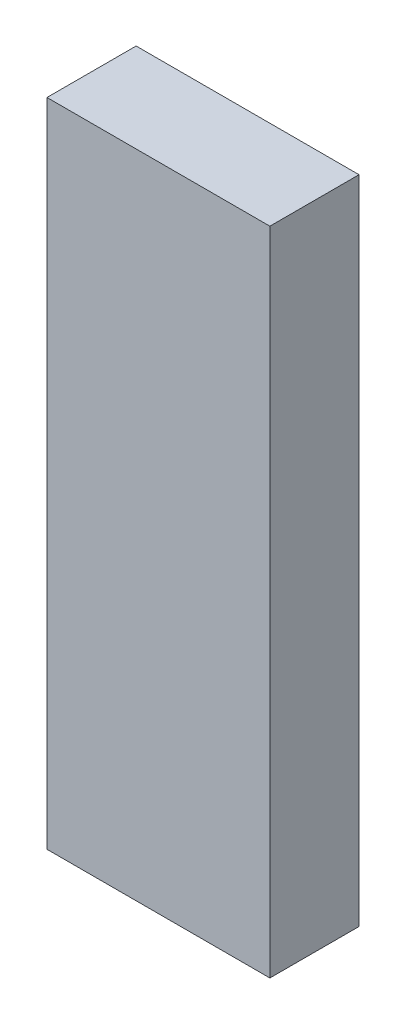
ISO-10303-21;
HEADER;
FILE_DESCRIPTION(('STEP AP214'),'2;1');
FILE_NAME('part.step','',(''),(''),'','','');
FILE_SCHEMA(('AUTOMOTIVE_DESIGN { 1 0 10303 214 1 1 1 1 }'));
ENDSEC;
DATA;
#1=APPLICATION_CONTEXT('core data for automotive mechanical design processes');
#2=APPLICATION_PROTOCOL_DEFINITION('international standard','automotive_design',2000,#1);
#3=PRODUCT_CONTEXT('',#1,'mechanical');
#4=PRODUCT('Part','Part','',(#3));
#5=PRODUCT_RELATED_PRODUCT_CATEGORY('part','',(#4));
#6=PRODUCT_DEFINITION_FORMATION('','',#4);
#7=PRODUCT_DEFINITION_CONTEXT('part definition',#1,'design');
#8=PRODUCT_DEFINITION('design','',#6,#7);
#9=PRODUCT_DEFINITION_SHAPE('','',#8);
#10=(LENGTH_UNIT() NAMED_UNIT(*) SI_UNIT(.MILLI.,.METRE.));
#11=(NAMED_UNIT(*) PLANE_ANGLE_UNIT() SI_UNIT($,.RADIAN.));
#12=(NAMED_UNIT(*) SI_UNIT($,.STERADIAN.) SOLID_ANGLE_UNIT());
#13=UNCERTAINTY_MEASURE_WITH_UNIT(LENGTH_MEASURE(1.E-05),#10,'distance_accuracy_value','');
#14=(GEOMETRIC_REPRESENTATION_CONTEXT(3) GLOBAL_UNCERTAINTY_ASSIGNED_CONTEXT((#13)) GLOBAL_UNIT_ASSIGNED_CONTEXT((#10,
#11,#12)) REPRESENTATION_CONTEXT('',''));
#15=CARTESIAN_POINT('',(0.,0.,0.));
#16=DIRECTION('',(0.,0.,1.));
#17=DIRECTION('',(1.,0.,0.));
#18=AXIS2_PLACEMENT_3D('',#15,#16,#17);
#19=CARTESIAN_POINT('',(0.1999996,0.5842,0.15999968));
#20=DIRECTION('',(0.,0.,1.));
#21=DIRECTION('',(1.,0.,0.));
#22=AXIS2_PLACEMENT_3D('',#19,#20,#21);
#23=PLANE('',#22);
#24=DIRECTION('',(0.,-1.,0.));
#25=VECTOR('',#24,1.);
#26=CARTESIAN_POINT('',(0.1999996,0.5842,0.15999968));
#27=LINE('',#26,#25);
#28=CARTESIAN_POINT('',(0.1999996,0.5842,0.15999968));
#29=VERTEX_POINT('',#28);
#30=CARTESIAN_POINT('',(0.1999996,-0.5842,0.15999968));
#31=VERTEX_POINT('',#30);
#32=EDGE_CURVE('E100',#29,#31,#27,.T.);
#33=ORIENTED_EDGE('',*,*,#32,.F.);
#34=DIRECTION('',(1.,0.,0.));
#35=VECTOR('',#34,1.);
#36=CARTESIAN_POINT('',(-0.1999996,0.5842,0.15999968));
#37=LINE('',#36,#35);
#38=CARTESIAN_POINT('',(-0.1999996,0.5842,0.15999968));
#39=VERTEX_POINT('',#38);
#40=EDGE_CURVE('E28',#39,#29,#37,.T.);
#41=ORIENTED_EDGE('',*,*,#40,.F.);
#42=DIRECTION('',(0.,1.,0.));
#43=VECTOR('',#42,1.);
#44=CARTESIAN_POINT('',(-0.1999996,-0.5842,0.15999968));
#45=LINE('',#44,#43);
#46=CARTESIAN_POINT('',(-0.1999996,-0.5842,0.15999968));
#47=VERTEX_POINT('',#46);
#48=EDGE_CURVE('E69',#47,#39,#45,.T.);
#49=ORIENTED_EDGE('',*,*,#48,.F.);
#50=DIRECTION('',(-1.,0.,0.));
#51=VECTOR('',#50,1.);
#52=CARTESIAN_POINT('',(0.1999996,-0.5842,0.15999968));
#53=LINE('',#52,#51);
#54=EDGE_CURVE('E82',#31,#47,#53,.T.);
#55=ORIENTED_EDGE('',*,*,#54,.F.);
#56=EDGE_LOOP('',(#33,#41,#49,#55));
#57=FACE_BOUND('',#56,.T.);
#58=ADVANCED_FACE('F17',(#57),#23,.T.);
#59=CARTESIAN_POINT('',(0.1999996,0.5842,0.));
#60=DIRECTION('',(0.,0.,1.));
#61=DIRECTION('',(1.,0.,0.));
#62=AXIS2_PLACEMENT_3D('',#59,#60,#61);
#63=PLANE('',#62);
#64=DIRECTION('',(0.,-1.,0.));
#65=VECTOR('',#64,1.);
#66=CARTESIAN_POINT('',(0.1999996,0.5842,0.));
#67=LINE('',#66,#65);
#68=CARTESIAN_POINT('',(0.1999996,0.5842,0.));
#69=VERTEX_POINT('',#68);
#70=CARTESIAN_POINT('',(0.1999996,-0.5842,0.));
#71=VERTEX_POINT('',#70);
#72=EDGE_CURVE('E88',#69,#71,#67,.T.);
#73=ORIENTED_EDGE('',*,*,#72,.T.);
#74=DIRECTION('',(-1.,0.,0.));
#75=VECTOR('',#74,1.);
#76=CARTESIAN_POINT('',(0.1999996,-0.5842,0.));
#77=LINE('',#76,#75);
#78=CARTESIAN_POINT('',(-0.1999996,-0.5842,0.));
#79=VERTEX_POINT('',#78);
#80=EDGE_CURVE('E76',#71,#79,#77,.T.);
#81=ORIENTED_EDGE('',*,*,#80,.T.);
#82=DIRECTION('',(0.,1.,0.));
#83=VECTOR('',#82,1.);
#84=CARTESIAN_POINT('',(-0.1999996,-0.5842,0.));
#85=LINE('',#84,#83);
#86=CARTESIAN_POINT('',(-0.1999996,0.5842,0.));
#87=VERTEX_POINT('',#86);
#88=EDGE_CURVE('E60',#79,#87,#85,.T.);
#89=ORIENTED_EDGE('',*,*,#88,.T.);
#90=DIRECTION('',(1.,0.,0.));
#91=VECTOR('',#90,1.);
#92=CARTESIAN_POINT('',(-0.1999996,0.5842,0.));
#93=LINE('',#92,#91);
#94=EDGE_CURVE('E11',#87,#69,#93,.T.);
#95=ORIENTED_EDGE('',*,*,#94,.T.);
#96=EDGE_LOOP('',(#73,#81,#89,#95));
#97=FACE_BOUND('',#96,.T.);
#98=ADVANCED_FACE('F19',(#97),#63,.F.);
#99=CARTESIAN_POINT('',(-0.1999996,0.5842,0.));
#100=DIRECTION('',(0.,1.,0.));
#101=DIRECTION('',(1.,0.,0.));
#102=AXIS2_PLACEMENT_3D('',#99,#100,#101);
#103=PLANE('',#102);
#104=DIRECTION('',(0.,0.,1.));
#105=VECTOR('',#104,1.);
#106=CARTESIAN_POINT('',(-0.1999996,0.5842,0.));
#107=LINE('',#106,#105);
#108=EDGE_CURVE('E111',#87,#39,#107,.T.);
#109=ORIENTED_EDGE('',*,*,#108,.T.);
#110=ORIENTED_EDGE('',*,*,#40,.T.);
#111=DIRECTION('',(0.,0.,1.));
#112=VECTOR('',#111,1.);
#113=CARTESIAN_POINT('',(0.1999996,0.5842,0.));
#114=LINE('',#113,#112);
#115=EDGE_CURVE('E94',#69,#29,#114,.T.);
#116=ORIENTED_EDGE('',*,*,#115,.F.);
#117=ORIENTED_EDGE('',*,*,#94,.F.);
#118=EDGE_LOOP('',(#109,#110,#116,#117));
#119=FACE_BOUND('',#118,.T.);
#120=ADVANCED_FACE('F98',(#119),#103,.T.);
#121=CARTESIAN_POINT('',(-0.1999996,-0.5842,0.));
#122=DIRECTION('',(-1.,0.,0.));
#123=DIRECTION('',(0.,0.,1.));
#124=AXIS2_PLACEMENT_3D('',#121,#122,#123);
#125=PLANE('',#124);
#126=DIRECTION('',(0.,0.,1.));
#127=VECTOR('',#126,1.);
#128=CARTESIAN_POINT('',(-0.1999996,-0.5842,0.));
#129=LINE('',#128,#127);
#130=EDGE_CURVE('E21',#79,#47,#129,.T.);
#131=ORIENTED_EDGE('',*,*,#130,.T.);
#132=ORIENTED_EDGE('',*,*,#48,.T.);
#133=ORIENTED_EDGE('',*,*,#108,.F.);
#134=ORIENTED_EDGE('',*,*,#88,.F.);
#135=EDGE_LOOP('',(#131,#132,#133,#134));
#136=FACE_BOUND('',#135,.T.);
#137=ADVANCED_FACE('F125',(#136),#125,.T.);
#138=CARTESIAN_POINT('',(0.1999996,-0.5842,0.));
#139=DIRECTION('',(0.,-1.,0.));
#140=DIRECTION('',(0.,0.,-1.));
#141=AXIS2_PLACEMENT_3D('',#138,#139,#140);
#142=PLANE('',#141);
#143=DIRECTION('',(0.,0.,1.));
#144=VECTOR('',#143,1.);
#145=CARTESIAN_POINT('',(0.1999996,-0.5842,0.));
#146=LINE('',#145,#144);
#147=EDGE_CURVE('E95',#71,#31,#146,.T.);
#148=ORIENTED_EDGE('',*,*,#147,.T.);
#149=ORIENTED_EDGE('',*,*,#54,.T.);
#150=ORIENTED_EDGE('',*,*,#130,.F.);
#151=ORIENTED_EDGE('',*,*,#80,.F.);
#152=EDGE_LOOP('',(#148,#149,#150,#151));
#153=FACE_BOUND('',#152,.T.);
#154=ADVANCED_FACE('F126',(#153),#142,.T.);
#155=CARTESIAN_POINT('',(0.1999996,0.5842,0.));
#156=DIRECTION('',(1.,0.,0.));
#157=DIRECTION('',(0.,1.,0.));
#158=AXIS2_PLACEMENT_3D('',#155,#156,#157);
#159=PLANE('',#158);
#160=ORIENTED_EDGE('',*,*,#115,.T.);
#161=ORIENTED_EDGE('',*,*,#32,.T.);
#162=ORIENTED_EDGE('',*,*,#147,.F.);
#163=ORIENTED_EDGE('',*,*,#72,.F.);
#164=EDGE_LOOP('',(#160,#161,#162,#163));
#165=FACE_BOUND('',#164,.T.);
#166=ADVANCED_FACE('F92',(#165),#159,.T.);
#167=CLOSED_SHELL('',(#58,#98,#120,#137,#154,#166));
#168=MANIFOLD_SOLID_BREP('B1',#167);
#169=ADVANCED_BREP_SHAPE_REPRESENTATION('',(#18,#168),#14);
#170=SHAPE_DEFINITION_REPRESENTATION(#9,#169);
ENDSEC;
END-ISO-10303-21;
